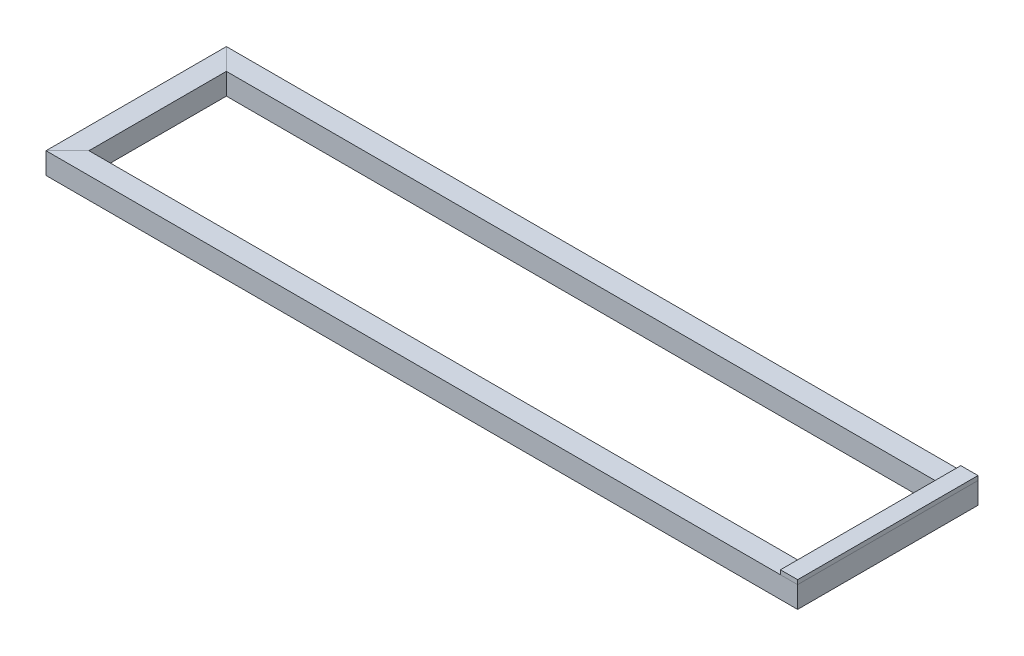
ISO-10303-21;
HEADER;
FILE_DESCRIPTION(('STEP AP214'),'2;1');
FILE_NAME('part.step','',(''),(''),'','','');
FILE_SCHEMA(('AUTOMOTIVE_DESIGN { 1 0 10303 214 1 1 1 1 }'));
ENDSEC;
DATA;
#1=APPLICATION_CONTEXT('core data for automotive mechanical design processes');
#2=APPLICATION_PROTOCOL_DEFINITION('international standard','automotive_design',2000,#1);
#3=PRODUCT_CONTEXT('',#1,'mechanical');
#4=PRODUCT('Part','Part','',(#3));
#5=PRODUCT_RELATED_PRODUCT_CATEGORY('part','',(#4));
#6=PRODUCT_DEFINITION_FORMATION('','',#4);
#7=PRODUCT_DEFINITION_CONTEXT('part definition',#1,'design');
#8=PRODUCT_DEFINITION('design','',#6,#7);
#9=PRODUCT_DEFINITION_SHAPE('','',#8);
#10=(LENGTH_UNIT() NAMED_UNIT(*) SI_UNIT(.MILLI.,.METRE.));
#11=(NAMED_UNIT(*) PLANE_ANGLE_UNIT() SI_UNIT($,.RADIAN.));
#12=(NAMED_UNIT(*) SI_UNIT($,.STERADIAN.) SOLID_ANGLE_UNIT());
#13=UNCERTAINTY_MEASURE_WITH_UNIT(LENGTH_MEASURE(1.E-05),#10,'distance_accuracy_value','');
#14=(GEOMETRIC_REPRESENTATION_CONTEXT(3) GLOBAL_UNCERTAINTY_ASSIGNED_CONTEXT((#13)) GLOBAL_UNIT_ASSIGNED_CONTEXT((#10,
#11,#12)) REPRESENTATION_CONTEXT('',''));
#15=CARTESIAN_POINT('',(0.,0.,0.));
#16=DIRECTION('',(0.,0.,1.));
#17=DIRECTION('',(1.,0.,0.));
#18=AXIS2_PLACEMENT_3D('',#15,#16,#17);
#19=CARTESIAN_POINT('',(875.,35.,-210.));
#20=DIRECTION('',(-1.,0.,0.));
#21=DIRECTION('',(0.,-1.,0.));
#22=AXIS2_PLACEMENT_3D('',#19,#20,#21);
#23=PLANE('',#22);
#24=DIRECTION('',(0.,0.,-1.));
#25=VECTOR('',#24,1.);
#26=CARTESIAN_POINT('',(875.,25.,-210.));
#27=LINE('',#26,#25);
#28=CARTESIAN_POINT('',(875.,25.,210.));
#29=VERTEX_POINT('',#28);
#30=CARTESIAN_POINT('',(875.,25.,-210.));
#31=VERTEX_POINT('',#30);
#32=EDGE_CURVE('E129',#29,#31,#27,.T.);
#33=ORIENTED_EDGE('',*,*,#32,.T.);
#34=DIRECTION('',(0.,-1.,0.));
#35=VECTOR('',#34,1.);
#36=CARTESIAN_POINT('',(875.,35.,-210.));
#37=LINE('',#36,#35);
#38=CARTESIAN_POINT('',(875.,35.,-210.));
#39=VERTEX_POINT('',#38);
#40=EDGE_CURVE('E13',#39,#31,#37,.T.);
#41=ORIENTED_EDGE('',*,*,#40,.F.);
#42=DIRECTION('',(0.,0.,-1.));
#43=VECTOR('',#42,1.);
#44=CARTESIAN_POINT('',(875.,35.,-210.));
#45=LINE('',#44,#43);
#46=CARTESIAN_POINT('',(875.,35.,210.));
#47=VERTEX_POINT('',#46);
#48=EDGE_CURVE('E117',#47,#39,#45,.T.);
#49=ORIENTED_EDGE('',*,*,#48,.F.);
#50=DIRECTION('',(0.,-1.,0.));
#51=VECTOR('',#50,1.);
#52=CARTESIAN_POINT('',(875.,35.,210.));
#53=LINE('',#52,#51);
#54=EDGE_CURVE('E125',#47,#29,#53,.T.);
#55=ORIENTED_EDGE('',*,*,#54,.T.);
#56=EDGE_LOOP('',(#33,#41,#49,#55));
#57=FACE_BOUND('',#56,.T.);
#58=ADVANCED_FACE('F66',(#57),#23,.F.);
#59=CARTESIAN_POINT('',(875.,35.,-210.));
#60=DIRECTION('',(0.,0.,1.));
#61=DIRECTION('',(1.,0.,0.));
#62=AXIS2_PLACEMENT_3D('',#59,#60,#61);
#63=PLANE('',#62);
#64=DIRECTION('',(-1.,0.,0.));
#65=VECTOR('',#64,1.);
#66=CARTESIAN_POINT('',(875.,25.,-210.));
#67=LINE('',#66,#65);
#68=CARTESIAN_POINT('',(835.,25.,-210.));
#69=VERTEX_POINT('',#68);
#70=EDGE_CURVE('E121',#31,#69,#67,.T.);
#71=ORIENTED_EDGE('',*,*,#70,.T.);
#72=DIRECTION('',(0.,-1.,0.));
#73=VECTOR('',#72,1.);
#74=CARTESIAN_POINT('',(835.,35.,-210.));
#75=LINE('',#74,#73);
#76=CARTESIAN_POINT('',(835.,35.,-210.));
#77=VERTEX_POINT('',#76);
#78=EDGE_CURVE('E74',#77,#69,#75,.T.);
#79=ORIENTED_EDGE('',*,*,#78,.F.);
#80=DIRECTION('',(-1.,0.,0.));
#81=VECTOR('',#80,1.);
#82=CARTESIAN_POINT('',(875.,35.,-210.));
#83=LINE('',#82,#81);
#84=EDGE_CURVE('E112',#39,#77,#83,.T.);
#85=ORIENTED_EDGE('',*,*,#84,.F.);
#86=ORIENTED_EDGE('',*,*,#40,.T.);
#87=EDGE_LOOP('',(#71,#79,#85,#86));
#88=FACE_BOUND('',#87,.T.);
#89=ADVANCED_FACE('F120',(#88),#63,.F.);
#90=CARTESIAN_POINT('',(835.,35.,-210.));
#91=DIRECTION('',(1.,0.,0.));
#92=DIRECTION('',(0.,1.,0.));
#93=AXIS2_PLACEMENT_3D('',#90,#91,#92);
#94=PLANE('',#93);
#95=DIRECTION('',(0.,0.,1.));
#96=VECTOR('',#95,1.);
#97=CARTESIAN_POINT('',(835.,25.,-210.));
#98=LINE('',#97,#96);
#99=CARTESIAN_POINT('',(835.,25.,210.));
#100=VERTEX_POINT('',#99);
#101=EDGE_CURVE('E99',#69,#100,#98,.T.);
#102=ORIENTED_EDGE('',*,*,#101,.T.);
#103=DIRECTION('',(0.,-1.,0.));
#104=VECTOR('',#103,1.);
#105=CARTESIAN_POINT('',(835.,35.,210.));
#106=LINE('',#105,#104);
#107=CARTESIAN_POINT('',(835.,35.,210.));
#108=VERTEX_POINT('',#107);
#109=EDGE_CURVE('E122',#108,#100,#106,.T.);
#110=ORIENTED_EDGE('',*,*,#109,.F.);
#111=DIRECTION('',(0.,0.,1.));
#112=VECTOR('',#111,1.);
#113=CARTESIAN_POINT('',(835.,35.,-210.));
#114=LINE('',#113,#112);
#115=EDGE_CURVE('E115',#77,#108,#114,.T.);
#116=ORIENTED_EDGE('',*,*,#115,.F.);
#117=ORIENTED_EDGE('',*,*,#78,.T.);
#118=EDGE_LOOP('',(#102,#110,#116,#117));
#119=FACE_BOUND('',#118,.T.);
#120=ADVANCED_FACE('F123',(#119),#94,.F.);
#121=CARTESIAN_POINT('',(875.,35.,210.));
#122=DIRECTION('',(0.,0.,-1.));
#123=DIRECTION('',(-1.,0.,0.));
#124=AXIS2_PLACEMENT_3D('',#121,#122,#123);
#125=PLANE('',#124);
#126=DIRECTION('',(1.,0.,0.));
#127=VECTOR('',#126,1.);
#128=CARTESIAN_POINT('',(875.,25.,210.));
#129=LINE('',#128,#127);
#130=EDGE_CURVE('E105',#100,#29,#129,.T.);
#131=ORIENTED_EDGE('',*,*,#130,.T.);
#132=ORIENTED_EDGE('',*,*,#54,.F.);
#133=DIRECTION('',(1.,0.,0.));
#134=VECTOR('',#133,1.);
#135=CARTESIAN_POINT('',(875.,35.,210.));
#136=LINE('',#135,#134);
#137=EDGE_CURVE('E82',#108,#47,#136,.T.);
#138=ORIENTED_EDGE('',*,*,#137,.F.);
#139=ORIENTED_EDGE('',*,*,#109,.T.);
#140=EDGE_LOOP('',(#131,#132,#138,#139));
#141=FACE_BOUND('',#140,.T.);
#142=ADVANCED_FACE('F136',(#141),#125,.F.);
#143=CARTESIAN_POINT('',(0.,35.0000000000002,0.));
#144=DIRECTION('',(0.,-1.,0.));
#145=DIRECTION('',(1.,0.,0.));
#146=AXIS2_PLACEMENT_3D('',#143,#144,#145);
#147=PLANE('',#146);
#148=ORIENTED_EDGE('',*,*,#48,.T.);
#149=ORIENTED_EDGE('',*,*,#84,.T.);
#150=ORIENTED_EDGE('',*,*,#115,.T.);
#151=ORIENTED_EDGE('',*,*,#137,.T.);
#152=EDGE_LOOP('',(#148,#149,#150,#151));
#153=FACE_BOUND('',#152,.T.);
#154=ADVANCED_FACE('F113',(#153),#147,.F.);
#155=CARTESIAN_POINT('',(0.,25.0000000000002,0.));
#156=DIRECTION('',(0.,-1.,0.));
#157=DIRECTION('',(1.,0.,0.));
#158=AXIS2_PLACEMENT_3D('',#155,#156,#157);
#159=PLANE('',#158);
#160=ORIENTED_EDGE('',*,*,#32,.F.);
#161=ORIENTED_EDGE('',*,*,#130,.F.);
#162=ORIENTED_EDGE('',*,*,#101,.F.);
#163=ORIENTED_EDGE('',*,*,#70,.F.);
#164=EDGE_LOOP('',(#160,#161,#162,#163));
#165=FACE_BOUND('',#164,.T.);
#166=ADVANCED_FACE('F139',(#165),#159,.T.);
#167=CLOSED_SHELL('',(#58,#89,#120,#142,#154,#166));
#168=MANIFOLD_SOLID_BREP('B2',#167);
#169=CARTESIAN_POINT('',(-875.,-25.,185.));
#170=DIRECTION('',(0.,1.,0.));
#171=DIRECTION('',(-1.,0.,0.));
#172=AXIS2_PLACEMENT_3D('',#169,#170,#171);
#173=PLANE('',#172);
#174=DIRECTION('',(-0.707106781186547,0.,-0.707106781186548));
#175=VECTOR('',#174,1.);
#176=CARTESIAN_POINT('',(-677.5,-25.,-12.4999999999999));
#177=LINE('',#176,#175);
#178=CARTESIAN_POINT('',(-825.,-25.,-160.));
#179=VERTEX_POINT('',#178);
#180=CARTESIAN_POINT('',(-875.,-25.,-210.));
#181=VERTEX_POINT('',#180);
#182=EDGE_CURVE('E255',#179,#181,#177,.T.);
#183=ORIENTED_EDGE('',*,*,#182,.F.);
#184=DIRECTION('',(0.,0.,-1.));
#185=VECTOR('',#184,1.);
#186=CARTESIAN_POINT('',(-825.,-25.,185.));
#187=LINE('',#186,#185);
#188=CARTESIAN_POINT('',(-825.,-25.,160.));
#189=VERTEX_POINT('',#188);
#190=EDGE_CURVE('E263',#189,#179,#187,.T.);
#191=ORIENTED_EDGE('',*,*,#190,.F.);
#192=DIRECTION('',(0.707106781186548,0.,-0.707106781186547));
#193=VECTOR('',#192,1.);
#194=CARTESIAN_POINT('',(-862.5,-25.,197.5));
#195=LINE('',#194,#193);
#196=CARTESIAN_POINT('',(-875.,-25.,210.));
#197=VERTEX_POINT('',#196);
#198=EDGE_CURVE('E247',#197,#189,#195,.T.);
#199=ORIENTED_EDGE('',*,*,#198,.F.);
#200=DIRECTION('',(0.,0.,-1.));
#201=VECTOR('',#200,1.);
#202=CARTESIAN_POINT('',(-875.,-25.,185.));
#203=LINE('',#202,#201);
#204=EDGE_CURVE('E204',#197,#181,#203,.T.);
#205=ORIENTED_EDGE('',*,*,#204,.T.);
#206=EDGE_LOOP('',(#183,#191,#199,#205));
#207=FACE_BOUND('',#206,.T.);
#208=ADVANCED_FACE('F200',(#207),#173,.F.);
#209=CARTESIAN_POINT('',(-825.,-25.,185.));
#210=DIRECTION('',(-1.,0.,0.));
#211=DIRECTION('',(0.,0.,1.));
#212=AXIS2_PLACEMENT_3D('',#209,#210,#211);
#213=PLANE('',#212);
#214=DIRECTION('',(0.,-1.,0.));
#215=VECTOR('',#214,1.);
#216=CARTESIAN_POINT('',(-825.,-25.,-160.));
#217=LINE('',#216,#215);
#218=CARTESIAN_POINT('',(-825.,25.,-160.));
#219=VERTEX_POINT('',#218);
#220=EDGE_CURVE('E252',#219,#179,#217,.T.);
#221=ORIENTED_EDGE('',*,*,#220,.F.);
#222=DIRECTION('',(0.,0.,-1.));
#223=VECTOR('',#222,1.);
#224=CARTESIAN_POINT('',(-825.,25.,185.));
#225=LINE('',#224,#223);
#226=CARTESIAN_POINT('',(-825.,25.,160.));
#227=VERTEX_POINT('',#226);
#228=EDGE_CURVE('E241',#227,#219,#225,.T.);
#229=ORIENTED_EDGE('',*,*,#228,.F.);
#230=DIRECTION('',(0.,1.,0.));
#231=VECTOR('',#230,1.);
#232=CARTESIAN_POINT('',(-825.,-25.,160.));
#233=LINE('',#232,#231);
#234=EDGE_CURVE('E251',#189,#227,#233,.T.);
#235=ORIENTED_EDGE('',*,*,#234,.F.);
#236=ORIENTED_EDGE('',*,*,#190,.T.);
#237=EDGE_LOOP('',(#221,#229,#235,#236));
#238=FACE_BOUND('',#237,.T.);
#239=ADVANCED_FACE('F274',(#238),#213,.F.);
#240=CARTESIAN_POINT('',(-825.,25.,185.));
#241=DIRECTION('',(0.,-1.,0.));
#242=DIRECTION('',(1.,0.,0.));
#243=AXIS2_PLACEMENT_3D('',#240,#241,#242);
#244=PLANE('',#243);
#245=DIRECTION('',(0.707106781186547,0.,0.707106781186548));
#246=VECTOR('',#245,1.);
#247=CARTESIAN_POINT('',(-652.5,25.,12.5000000000001));
#248=LINE('',#247,#246);
#249=CARTESIAN_POINT('',(-875.,25.,-210.));
#250=VERTEX_POINT('',#249);
#251=EDGE_CURVE('E64',#250,#219,#248,.T.);
#252=ORIENTED_EDGE('',*,*,#251,.F.);
#253=DIRECTION('',(0.,0.,-1.));
#254=VECTOR('',#253,1.);
#255=CARTESIAN_POINT('',(-875.,25.,185.));
#256=LINE('',#255,#254);
#257=CARTESIAN_POINT('',(-875.,25.,210.));
#258=VERTEX_POINT('',#257);
#259=EDGE_CURVE('E217',#258,#250,#256,.T.);
#260=ORIENTED_EDGE('',*,*,#259,.F.);
#261=DIRECTION('',(-0.707106781186548,0.,0.707106781186547));
#262=VECTOR('',#261,1.);
#263=CARTESIAN_POINT('',(-837.5,25.,172.5));
#264=LINE('',#263,#262);
#265=EDGE_CURVE('E237',#227,#258,#264,.T.);
#266=ORIENTED_EDGE('',*,*,#265,.F.);
#267=ORIENTED_EDGE('',*,*,#228,.T.);
#268=EDGE_LOOP('',(#252,#260,#266,#267));
#269=FACE_BOUND('',#268,.T.);
#270=ADVANCED_FACE('F234',(#269),#244,.F.);
#271=CARTESIAN_POINT('',(-875.,25.,185.));
#272=DIRECTION('',(1.,0.,0.));
#273=DIRECTION('',(0.,0.,-1.));
#274=AXIS2_PLACEMENT_3D('',#271,#272,#273);
#275=PLANE('',#274);
#276=DIRECTION('',(0.,1.,0.));
#277=VECTOR('',#276,1.);
#278=CARTESIAN_POINT('',(-875.,25.,-210.));
#279=LINE('',#278,#277);
#280=EDGE_CURVE('E209',#181,#250,#279,.T.);
#281=ORIENTED_EDGE('',*,*,#280,.F.);
#282=ORIENTED_EDGE('',*,*,#204,.F.);
#283=DIRECTION('',(0.,-1.,0.));
#284=VECTOR('',#283,1.);
#285=CARTESIAN_POINT('',(-875.,25.,210.));
#286=LINE('',#285,#284);
#287=EDGE_CURVE('E240',#258,#197,#286,.T.);
#288=ORIENTED_EDGE('',*,*,#287,.F.);
#289=ORIENTED_EDGE('',*,*,#259,.T.);
#290=EDGE_LOOP('',(#281,#282,#288,#289));
#291=FACE_BOUND('',#290,.T.);
#292=ADVANCED_FACE('F244',(#291),#275,.F.);
#293=CARTESIAN_POINT('',(-850.,0.,185.));
#294=DIRECTION('',(0.707106781186547,0.,0.707106781186548));
#295=DIRECTION('',(0.707106781186548,0.,-0.707106781186547));
#296=AXIS2_PLACEMENT_3D('',#293,#294,#295);
#297=PLANE('',#296);
#298=ORIENTED_EDGE('',*,*,#287,.T.);
#299=ORIENTED_EDGE('',*,*,#198,.T.);
#300=ORIENTED_EDGE('',*,*,#234,.T.);
#301=ORIENTED_EDGE('',*,*,#265,.T.);
#302=EDGE_LOOP('',(#298,#299,#300,#301));
#303=FACE_BOUND('',#302,.T.);
#304=ADVANCED_FACE('F250',(#303),#297,.T.);
#305=CARTESIAN_POINT('',(-850.,0.,-185.));
#306=DIRECTION('',(0.707106781186548,0.,-0.707106781186547));
#307=DIRECTION('',(-0.707106781186547,0.,-0.707106781186548));
#308=AXIS2_PLACEMENT_3D('',#305,#306,#307);
#309=PLANE('',#308);
#310=ORIENTED_EDGE('',*,*,#220,.T.);
#311=ORIENTED_EDGE('',*,*,#182,.T.);
#312=ORIENTED_EDGE('',*,*,#280,.T.);
#313=ORIENTED_EDGE('',*,*,#251,.T.);
#314=EDGE_LOOP('',(#310,#311,#312,#313));
#315=FACE_BOUND('',#314,.T.);
#316=ADVANCED_FACE('F202',(#315),#309,.T.);
#317=CLOSED_SHELL('',(#208,#239,#270,#292,#304,#316));
#318=MANIFOLD_SOLID_BREP('B7',#317);
#319=CARTESIAN_POINT('',(-850.,-25.,-210.));
#320=DIRECTION('',(0.,1.,0.));
#321=DIRECTION('',(0.,0.,1.));
#322=AXIS2_PLACEMENT_3D('',#319,#320,#321);
#323=PLANE('',#322);
#324=DIRECTION('',(0.707106781186548,0.,0.707106781186548));
#325=VECTOR('',#324,1.);
#326=CARTESIAN_POINT('',(-862.5,-25.,-197.5));
#327=LINE('',#326,#325);
#328=CARTESIAN_POINT('',(-875.000000000001,-25.,-210.));
#329=VERTEX_POINT('',#328);
#330=CARTESIAN_POINT('',(-825.000000000001,-25.,-160.));
#331=VERTEX_POINT('',#330);
#332=EDGE_CURVE('E414',#329,#331,#327,.T.);
#333=ORIENTED_EDGE('',*,*,#332,.F.);
#334=DIRECTION('',(1.,0.,0.));
#335=VECTOR('',#334,1.);
#336=CARTESIAN_POINT('',(-850.,-25.,-210.));
#337=LINE('',#336,#335);
#338=CARTESIAN_POINT('',(875.,-25.,-210.));
#339=VERTEX_POINT('',#338);
#340=EDGE_CURVE('E369',#329,#339,#337,.T.);
#341=ORIENTED_EDGE('',*,*,#340,.T.);
#342=DIRECTION('',(0.707106781186548,0.,-0.707106781186547));
#343=VECTOR('',#342,1.);
#344=CARTESIAN_POINT('',(12.4999999999998,-25.0000000000001,652.5));
#345=LINE('',#344,#343);
#346=CARTESIAN_POINT('',(825.,-25.,-160.));
#347=VERTEX_POINT('',#346);
#348=EDGE_CURVE('E418',#347,#339,#345,.T.);
#349=ORIENTED_EDGE('',*,*,#348,.F.);
#350=DIRECTION('',(1.,0.,0.));
#351=VECTOR('',#350,1.);
#352=CARTESIAN_POINT('',(-850.,-25.,-160.));
#353=LINE('',#352,#351);
#354=EDGE_CURVE('E410',#331,#347,#353,.T.);
#355=ORIENTED_EDGE('',*,*,#354,.F.);
#356=EDGE_LOOP('',(#333,#341,#349,#355));
#357=FACE_BOUND('',#356,.T.);
#358=ADVANCED_FACE('F365',(#357),#323,.F.);
#359=CARTESIAN_POINT('',(-850.,-25.,-160.));
#360=DIRECTION('',(0.,0.,-1.));
#361=DIRECTION('',(-1.,0.,0.));
#362=AXIS2_PLACEMENT_3D('',#359,#360,#361);
#363=PLANE('',#362);
#364=DIRECTION('',(0.,1.,0.));
#365=VECTOR('',#364,1.);
#366=CARTESIAN_POINT('',(-825.000000000001,-25.,-160.));
#367=LINE('',#366,#365);
#368=CARTESIAN_POINT('',(-825.000000000001,25.,-160.));
#369=VERTEX_POINT('',#368);
#370=EDGE_CURVE('E374',#331,#369,#367,.T.);
#371=ORIENTED_EDGE('',*,*,#370,.F.);
#372=ORIENTED_EDGE('',*,*,#354,.T.);
#373=DIRECTION('',(0.,-1.,0.));
#374=VECTOR('',#373,1.);
#375=CARTESIAN_POINT('',(825.,-25.,-160.));
#376=LINE('',#375,#374);
#377=CARTESIAN_POINT('',(825.,25.,-160.));
#378=VERTEX_POINT('',#377);
#379=EDGE_CURVE('E426',#378,#347,#376,.T.);
#380=ORIENTED_EDGE('',*,*,#379,.F.);
#381=DIRECTION('',(1.,0.,0.));
#382=VECTOR('',#381,1.);
#383=CARTESIAN_POINT('',(-850.,25.,-160.));
#384=LINE('',#383,#382);
#385=EDGE_CURVE('E411',#369,#378,#384,.T.);
#386=ORIENTED_EDGE('',*,*,#385,.F.);
#387=EDGE_LOOP('',(#371,#372,#380,#386));
#388=FACE_BOUND('',#387,.T.);
#389=ADVANCED_FACE('F408',(#388),#363,.F.);
#390=CARTESIAN_POINT('',(-850.,25.,-160.));
#391=DIRECTION('',(0.,-1.,0.));
#392=DIRECTION('',(0.,0.,-1.));
#393=AXIS2_PLACEMENT_3D('',#390,#391,#392);
#394=PLANE('',#393);
#395=DIRECTION('',(-0.707106781186548,0.,-0.707106781186548));
#396=VECTOR('',#395,1.);
#397=CARTESIAN_POINT('',(-837.5,25.,-172.5));
#398=LINE('',#397,#396);
#399=CARTESIAN_POINT('',(-875.000000000001,25.,-210.));
#400=VERTEX_POINT('',#399);
#401=EDGE_CURVE('E198',#369,#400,#398,.T.);
#402=ORIENTED_EDGE('',*,*,#401,.F.);
#403=ORIENTED_EDGE('',*,*,#385,.T.);
#404=DIRECTION('',(-0.707106781186548,0.,0.707106781186547));
#405=VECTOR('',#404,1.);
#406=CARTESIAN_POINT('',(-12.5000000000002,25.0000000000001,677.5));
#407=LINE('',#406,#405);
#408=CARTESIAN_POINT('',(875.,25.,-210.));
#409=VERTEX_POINT('',#408);
#410=EDGE_CURVE('E422',#409,#378,#407,.T.);
#411=ORIENTED_EDGE('',*,*,#410,.F.);
#412=DIRECTION('',(1.,0.,0.));
#413=VECTOR('',#412,1.);
#414=CARTESIAN_POINT('',(-850.,25.,-210.));
#415=LINE('',#414,#413);
#416=EDGE_CURVE('E387',#400,#409,#415,.T.);
#417=ORIENTED_EDGE('',*,*,#416,.F.);
#418=EDGE_LOOP('',(#402,#403,#411,#417));
#419=FACE_BOUND('',#418,.T.);
#420=ADVANCED_FACE('F429',(#419),#394,.F.);
#421=CARTESIAN_POINT('',(-850.,25.,-210.));
#422=DIRECTION('',(0.,0.,1.));
#423=DIRECTION('',(1.,0.,0.));
#424=AXIS2_PLACEMENT_3D('',#421,#422,#423);
#425=PLANE('',#424);
#426=DIRECTION('',(0.,-1.,0.));
#427=VECTOR('',#426,1.);
#428=CARTESIAN_POINT('',(-875.000000000001,25.,-210.));
#429=LINE('',#428,#427);
#430=EDGE_CURVE('E420',#400,#329,#429,.T.);
#431=ORIENTED_EDGE('',*,*,#430,.F.);
#432=ORIENTED_EDGE('',*,*,#416,.T.);
#433=DIRECTION('',(0.,1.,0.));
#434=VECTOR('',#433,1.);
#435=CARTESIAN_POINT('',(875.,25.,-210.));
#436=LINE('',#435,#434);
#437=EDGE_CURVE('E435',#339,#409,#436,.T.);
#438=ORIENTED_EDGE('',*,*,#437,.F.);
#439=ORIENTED_EDGE('',*,*,#340,.F.);
#440=EDGE_LOOP('',(#431,#432,#438,#439));
#441=FACE_BOUND('',#440,.T.);
#442=ADVANCED_FACE('F439',(#441),#425,.F.);
#443=CARTESIAN_POINT('',(850.,0.,-185.));
#444=DIRECTION('',(0.707106781186547,0.,0.707106781186548));
#445=DIRECTION('',(0.707106781186548,0.,-0.707106781186547));
#446=AXIS2_PLACEMENT_3D('',#443,#444,#445);
#447=PLANE('',#446);
#448=ORIENTED_EDGE('',*,*,#379,.T.);
#449=ORIENTED_EDGE('',*,*,#348,.T.);
#450=ORIENTED_EDGE('',*,*,#437,.T.);
#451=ORIENTED_EDGE('',*,*,#410,.T.);
#452=EDGE_LOOP('',(#448,#449,#450,#451));
#453=FACE_BOUND('',#452,.T.);
#454=ADVANCED_FACE('F434',(#453),#447,.T.);
#455=CARTESIAN_POINT('',(-850.,0.,-185.));
#456=DIRECTION('',(-0.707106781186548,0.,0.707106781186548));
#457=DIRECTION('',(0.707106781186548,0.,0.707106781186548));
#458=AXIS2_PLACEMENT_3D('',#455,#456,#457);
#459=PLANE('',#458);
#460=ORIENTED_EDGE('',*,*,#430,.T.);
#461=ORIENTED_EDGE('',*,*,#332,.T.);
#462=ORIENTED_EDGE('',*,*,#370,.T.);
#463=ORIENTED_EDGE('',*,*,#401,.T.);
#464=EDGE_LOOP('',(#460,#461,#462,#463));
#465=FACE_BOUND('',#464,.T.);
#466=ADVANCED_FACE('F367',(#465),#459,.T.);
#467=CLOSED_SHELL('',(#358,#389,#420,#442,#454,#466));
#468=MANIFOLD_SOLID_BREP('B58',#467);
#469=CARTESIAN_POINT('',(850.,-25.,210.));
#470=DIRECTION('',(0.,1.,0.));
#471=DIRECTION('',(0.,0.,1.));
#472=AXIS2_PLACEMENT_3D('',#469,#470,#471);
#473=PLANE('',#472);
#474=DIRECTION('',(-0.707106781186547,0.,0.707106781186548));
#475=VECTOR('',#474,1.);
#476=CARTESIAN_POINT('',(-12.5000000000004,-25.0000000000001,-652.5));
#477=LINE('',#476,#475);
#478=CARTESIAN_POINT('',(-825.,-25.,160.));
#479=VERTEX_POINT('',#478);
#480=CARTESIAN_POINT('',(-875.,-25.,210.));
#481=VERTEX_POINT('',#480);
#482=EDGE_CURVE('E582',#479,#481,#477,.T.);
#483=ORIENTED_EDGE('',*,*,#482,.F.);
#484=DIRECTION('',(-1.,0.,0.));
#485=VECTOR('',#484,1.);
#486=CARTESIAN_POINT('',(850.,-25.,160.));
#487=LINE('',#486,#485);
#488=CARTESIAN_POINT('',(825.,-25.,160.));
#489=VERTEX_POINT('',#488);
#490=EDGE_CURVE('E590',#489,#479,#487,.T.);
#491=ORIENTED_EDGE('',*,*,#490,.F.);
#492=DIRECTION('',(-0.707106781186547,0.,-0.707106781186548));
#493=VECTOR('',#492,1.);
#494=CARTESIAN_POINT('',(862.5,-25.,197.5));
#495=LINE('',#494,#493);
#496=CARTESIAN_POINT('',(875.,-25.,210.));
#497=VERTEX_POINT('',#496);
#498=EDGE_CURVE('E574',#497,#489,#495,.T.);
#499=ORIENTED_EDGE('',*,*,#498,.F.);
#500=DIRECTION('',(-1.,0.,0.));
#501=VECTOR('',#500,1.);
#502=CARTESIAN_POINT('',(850.,-25.,210.));
#503=LINE('',#502,#501);
#504=EDGE_CURVE('E531',#497,#481,#503,.T.);
#505=ORIENTED_EDGE('',*,*,#504,.T.);
#506=EDGE_LOOP('',(#483,#491,#499,#505));
#507=FACE_BOUND('',#506,.T.);
#508=ADVANCED_FACE('F527',(#507),#473,.F.);
#509=CARTESIAN_POINT('',(850.,-25.,160.));
#510=DIRECTION('',(0.,0.,1.));
#511=DIRECTION('',(1.,0.,0.));
#512=AXIS2_PLACEMENT_3D('',#509,#510,#511);
#513=PLANE('',#512);
#514=DIRECTION('',(0.,-1.,0.));
#515=VECTOR('',#514,1.);
#516=CARTESIAN_POINT('',(-825.,-25.,160.));
#517=LINE('',#516,#515);
#518=CARTESIAN_POINT('',(-825.,25.,160.));
#519=VERTEX_POINT('',#518);
#520=EDGE_CURVE('E579',#519,#479,#517,.T.);
#521=ORIENTED_EDGE('',*,*,#520,.F.);
#522=DIRECTION('',(-1.,0.,0.));
#523=VECTOR('',#522,1.);
#524=CARTESIAN_POINT('',(850.,25.,160.));
#525=LINE('',#524,#523);
#526=CARTESIAN_POINT('',(825.,25.,160.));
#527=VERTEX_POINT('',#526);
#528=EDGE_CURVE('E568',#527,#519,#525,.T.);
#529=ORIENTED_EDGE('',*,*,#528,.F.);
#530=DIRECTION('',(0.,1.,0.));
#531=VECTOR('',#530,1.);
#532=CARTESIAN_POINT('',(825.,-25.,160.));
#533=LINE('',#532,#531);
#534=EDGE_CURVE('E578',#489,#527,#533,.T.);
#535=ORIENTED_EDGE('',*,*,#534,.F.);
#536=ORIENTED_EDGE('',*,*,#490,.T.);
#537=EDGE_LOOP('',(#521,#529,#535,#536));
#538=FACE_BOUND('',#537,.T.);
#539=ADVANCED_FACE('F601',(#538),#513,.F.);
#540=CARTESIAN_POINT('',(850.,25.,160.));
#541=DIRECTION('',(0.,-1.,0.));
#542=DIRECTION('',(0.,0.,-1.));
#543=AXIS2_PLACEMENT_3D('',#540,#541,#542);
#544=PLANE('',#543);
#545=DIRECTION('',(0.707106781186547,0.,-0.707106781186548));
#546=VECTOR('',#545,1.);
#547=CARTESIAN_POINT('',(12.4999999999996,25.0000000000001,-677.5));
#548=LINE('',#547,#546);
#549=CARTESIAN_POINT('',(-875.,25.,210.));
#550=VERTEX_POINT('',#549);
#551=EDGE_CURVE('E363',#550,#519,#548,.T.);
#552=ORIENTED_EDGE('',*,*,#551,.F.);
#553=DIRECTION('',(-1.,0.,0.));
#554=VECTOR('',#553,1.);
#555=CARTESIAN_POINT('',(850.,25.,210.));
#556=LINE('',#555,#554);
#557=CARTESIAN_POINT('',(875.,25.,210.));
#558=VERTEX_POINT('',#557);
#559=EDGE_CURVE('E544',#558,#550,#556,.T.);
#560=ORIENTED_EDGE('',*,*,#559,.F.);
#561=DIRECTION('',(0.707106781186547,0.,0.707106781186548));
#562=VECTOR('',#561,1.);
#563=CARTESIAN_POINT('',(837.5,25.,172.5));
#564=LINE('',#563,#562);
#565=EDGE_CURVE('E564',#527,#558,#564,.T.);
#566=ORIENTED_EDGE('',*,*,#565,.F.);
#567=ORIENTED_EDGE('',*,*,#528,.T.);
#568=EDGE_LOOP('',(#552,#560,#566,#567));
#569=FACE_BOUND('',#568,.T.);
#570=ADVANCED_FACE('F561',(#569),#544,.F.);
#571=CARTESIAN_POINT('',(850.,25.,210.));
#572=DIRECTION('',(0.,0.,-1.));
#573=DIRECTION('',(-1.,0.,0.));
#574=AXIS2_PLACEMENT_3D('',#571,#572,#573);
#575=PLANE('',#574);
#576=DIRECTION('',(0.,1.,0.));
#577=VECTOR('',#576,1.);
#578=CARTESIAN_POINT('',(-875.,25.,210.));
#579=LINE('',#578,#577);
#580=EDGE_CURVE('E536',#481,#550,#579,.T.);
#581=ORIENTED_EDGE('',*,*,#580,.F.);
#582=ORIENTED_EDGE('',*,*,#504,.F.);
#583=DIRECTION('',(0.,-1.,0.));
#584=VECTOR('',#583,1.);
#585=CARTESIAN_POINT('',(875.,25.,210.));
#586=LINE('',#585,#584);
#587=EDGE_CURVE('E567',#558,#497,#586,.T.);
#588=ORIENTED_EDGE('',*,*,#587,.F.);
#589=ORIENTED_EDGE('',*,*,#559,.T.);
#590=EDGE_LOOP('',(#581,#582,#588,#589));
#591=FACE_BOUND('',#590,.T.);
#592=ADVANCED_FACE('F571',(#591),#575,.F.);
#593=CARTESIAN_POINT('',(850.,0.,185.));
#594=DIRECTION('',(0.707106781186548,0.,-0.707106781186547));
#595=DIRECTION('',(-0.707106781186547,0.,-0.707106781186548));
#596=AXIS2_PLACEMENT_3D('',#593,#594,#595);
#597=PLANE('',#596);
#598=ORIENTED_EDGE('',*,*,#587,.T.);
#599=ORIENTED_EDGE('',*,*,#498,.T.);
#600=ORIENTED_EDGE('',*,*,#534,.T.);
#601=ORIENTED_EDGE('',*,*,#565,.T.);
#602=EDGE_LOOP('',(#598,#599,#600,#601));
#603=FACE_BOUND('',#602,.T.);
#604=ADVANCED_FACE('F577',(#603),#597,.T.);
#605=CARTESIAN_POINT('',(-850.,0.,185.));
#606=DIRECTION('',(-0.707106781186548,0.,-0.707106781186547));
#607=DIRECTION('',(-0.707106781186547,0.,0.707106781186548));
#608=AXIS2_PLACEMENT_3D('',#605,#606,#607);
#609=PLANE('',#608);
#610=ORIENTED_EDGE('',*,*,#520,.T.);
#611=ORIENTED_EDGE('',*,*,#482,.T.);
#612=ORIENTED_EDGE('',*,*,#580,.T.);
#613=ORIENTED_EDGE('',*,*,#551,.T.);
#614=EDGE_LOOP('',(#610,#611,#612,#613));
#615=FACE_BOUND('',#614,.T.);
#616=ADVANCED_FACE('F529',(#615),#609,.T.);
#617=CLOSED_SHELL('',(#508,#539,#570,#592,#604,#616));
#618=MANIFOLD_SOLID_BREP('B192',#617);
#619=CARTESIAN_POINT('',(875.,-25.,-185.));
#620=DIRECTION('',(0.,1.,0.));
#621=DIRECTION('',(-1.,0.,0.));
#622=AXIS2_PLACEMENT_3D('',#619,#620,#621);
#623=PLANE('',#622);
#624=DIRECTION('',(0.707106781186547,0.,0.707106781186548));
#625=VECTOR('',#624,1.);
#626=CARTESIAN_POINT('',(677.5,-25.,12.5000000000003));
#627=LINE('',#626,#625);
#628=CARTESIAN_POINT('',(825.,-25.,160.));
#629=VERTEX_POINT('',#628);
#630=CARTESIAN_POINT('',(875.,-25.,210.000000000001));
#631=VERTEX_POINT('',#630);
#632=EDGE_CURVE('E735',#629,#631,#627,.T.);
#633=ORIENTED_EDGE('',*,*,#632,.F.);
#634=DIRECTION('',(0.,0.,1.));
#635=VECTOR('',#634,1.);
#636=CARTESIAN_POINT('',(825.,-25.,-185.));
#637=LINE('',#636,#635);
#638=CARTESIAN_POINT('',(825.,-25.,-160.));
#639=VERTEX_POINT('',#638);
#640=EDGE_CURVE('E743',#639,#629,#637,.T.);
#641=ORIENTED_EDGE('',*,*,#640,.F.);
#642=DIRECTION('',(-0.707106781186548,0.,0.707106781186547));
#643=VECTOR('',#642,1.);
#644=CARTESIAN_POINT('',(862.5,-25.,-197.5));
#645=LINE('',#644,#643);
#646=CARTESIAN_POINT('',(875.,-25.,-210.));
#647=VERTEX_POINT('',#646);
#648=EDGE_CURVE('E727',#647,#639,#645,.T.);
#649=ORIENTED_EDGE('',*,*,#648,.F.);
#650=DIRECTION('',(0.,0.,1.));
#651=VECTOR('',#650,1.);
#652=CARTESIAN_POINT('',(875.,-25.,-185.));
#653=LINE('',#652,#651);
#654=EDGE_CURVE('E684',#647,#631,#653,.T.);
#655=ORIENTED_EDGE('',*,*,#654,.T.);
#656=EDGE_LOOP('',(#633,#641,#649,#655));
#657=FACE_BOUND('',#656,.T.);
#658=ADVANCED_FACE('F680',(#657),#623,.F.);
#659=CARTESIAN_POINT('',(825.,-25.,-185.));
#660=DIRECTION('',(1.,0.,0.));
#661=DIRECTION('',(0.,0.,-1.));
#662=AXIS2_PLACEMENT_3D('',#659,#660,#661);
#663=PLANE('',#662);
#664=DIRECTION('',(0.,-1.,0.));
#665=VECTOR('',#664,1.);
#666=CARTESIAN_POINT('',(825.,-25.,160.));
#667=LINE('',#666,#665);
#668=CARTESIAN_POINT('',(825.,25.,160.));
#669=VERTEX_POINT('',#668);
#670=EDGE_CURVE('E732',#669,#629,#667,.T.);
#671=ORIENTED_EDGE('',*,*,#670,.F.);
#672=DIRECTION('',(0.,0.,1.));
#673=VECTOR('',#672,1.);
#674=CARTESIAN_POINT('',(825.,25.,-185.));
#675=LINE('',#674,#673);
#676=CARTESIAN_POINT('',(825.,25.,-160.));
#677=VERTEX_POINT('',#676);
#678=EDGE_CURVE('E721',#677,#669,#675,.T.);
#679=ORIENTED_EDGE('',*,*,#678,.F.);
#680=DIRECTION('',(0.,1.,0.));
#681=VECTOR('',#680,1.);
#682=CARTESIAN_POINT('',(825.,-25.,-160.));
#683=LINE('',#682,#681);
#684=EDGE_CURVE('E731',#639,#677,#683,.T.);
#685=ORIENTED_EDGE('',*,*,#684,.F.);
#686=ORIENTED_EDGE('',*,*,#640,.T.);
#687=EDGE_LOOP('',(#671,#679,#685,#686));
#688=FACE_BOUND('',#687,.T.);
#689=ADVANCED_FACE('F754',(#688),#663,.F.);
#690=CARTESIAN_POINT('',(825.,25.,-185.));
#691=DIRECTION('',(0.,-1.,0.));
#692=DIRECTION('',(1.,0.,0.));
#693=AXIS2_PLACEMENT_3D('',#690,#691,#692);
#694=PLANE('',#693);
#695=DIRECTION('',(-0.707106781186547,0.,-0.707106781186548));
#696=VECTOR('',#695,1.);
#697=CARTESIAN_POINT('',(652.5,25.,-12.4999999999998));
#698=LINE('',#697,#696);
#699=CARTESIAN_POINT('',(875.,25.,210.000000000001));
#700=VERTEX_POINT('',#699);
#701=EDGE_CURVE('E525',#700,#669,#698,.T.);
#702=ORIENTED_EDGE('',*,*,#701,.F.);
#703=DIRECTION('',(0.,0.,1.));
#704=VECTOR('',#703,1.);
#705=CARTESIAN_POINT('',(875.,25.,-185.));
#706=LINE('',#705,#704);
#707=CARTESIAN_POINT('',(875.,25.,-210.));
#708=VERTEX_POINT('',#707);
#709=EDGE_CURVE('E697',#708,#700,#706,.T.);
#710=ORIENTED_EDGE('',*,*,#709,.F.);
#711=DIRECTION('',(0.707106781186548,0.,-0.707106781186547));
#712=VECTOR('',#711,1.);
#713=CARTESIAN_POINT('',(837.5,25.,-172.5));
#714=LINE('',#713,#712);
#715=EDGE_CURVE('E717',#677,#708,#714,.T.);
#716=ORIENTED_EDGE('',*,*,#715,.F.);
#717=ORIENTED_EDGE('',*,*,#678,.T.);
#718=EDGE_LOOP('',(#702,#710,#716,#717));
#719=FACE_BOUND('',#718,.T.);
#720=ADVANCED_FACE('F714',(#719),#694,.F.);
#721=CARTESIAN_POINT('',(875.,25.,-185.));
#722=DIRECTION('',(-1.,0.,0.));
#723=DIRECTION('',(0.,0.,1.));
#724=AXIS2_PLACEMENT_3D('',#721,#722,#723);
#725=PLANE('',#724);
#726=DIRECTION('',(0.,1.,0.));
#727=VECTOR('',#726,1.);
#728=CARTESIAN_POINT('',(875.,25.,210.000000000001));
#729=LINE('',#728,#727);
#730=EDGE_CURVE('E689',#631,#700,#729,.T.);
#731=ORIENTED_EDGE('',*,*,#730,.F.);
#732=ORIENTED_EDGE('',*,*,#654,.F.);
#733=DIRECTION('',(0.,-1.,0.));
#734=VECTOR('',#733,1.);
#735=CARTESIAN_POINT('',(875.,25.,-210.));
#736=LINE('',#735,#734);
#737=EDGE_CURVE('E720',#708,#647,#736,.T.);
#738=ORIENTED_EDGE('',*,*,#737,.F.);
#739=ORIENTED_EDGE('',*,*,#709,.T.);
#740=EDGE_LOOP('',(#731,#732,#738,#739));
#741=FACE_BOUND('',#740,.T.);
#742=ADVANCED_FACE('F724',(#741),#725,.F.);
#743=CARTESIAN_POINT('',(850.,0.,-185.));
#744=DIRECTION('',(-0.707106781186547,0.,-0.707106781186548));
#745=DIRECTION('',(-0.707106781186548,0.,0.707106781186547));
#746=AXIS2_PLACEMENT_3D('',#743,#744,#745);
#747=PLANE('',#746);
#748=ORIENTED_EDGE('',*,*,#737,.T.);
#749=ORIENTED_EDGE('',*,*,#648,.T.);
#750=ORIENTED_EDGE('',*,*,#684,.T.);
#751=ORIENTED_EDGE('',*,*,#715,.T.);
#752=EDGE_LOOP('',(#748,#749,#750,#751));
#753=FACE_BOUND('',#752,.T.);
#754=ADVANCED_FACE('F730',(#753),#747,.T.);
#755=CARTESIAN_POINT('',(850.,0.,185.));
#756=DIRECTION('',(-0.707106781186548,0.,0.707106781186547));
#757=DIRECTION('',(0.707106781186547,0.,0.707106781186548));
#758=AXIS2_PLACEMENT_3D('',#755,#756,#757);
#759=PLANE('',#758);
#760=ORIENTED_EDGE('',*,*,#670,.T.);
#761=ORIENTED_EDGE('',*,*,#632,.T.);
#762=ORIENTED_EDGE('',*,*,#730,.T.);
#763=ORIENTED_EDGE('',*,*,#701,.T.);
#764=EDGE_LOOP('',(#760,#761,#762,#763));
#765=FACE_BOUND('',#764,.T.);
#766=ADVANCED_FACE('F682',(#765),#759,.T.);
#767=CLOSED_SHELL('',(#658,#689,#720,#742,#754,#766));
#768=MANIFOLD_SOLID_BREP('B357',#767);
#769=ADVANCED_BREP_SHAPE_REPRESENTATION('',(#18,#168,#318,#468,#618,#768),#14);
#770=SHAPE_DEFINITION_REPRESENTATION(#9,#769);
ENDSEC;
END-ISO-10303-21;
